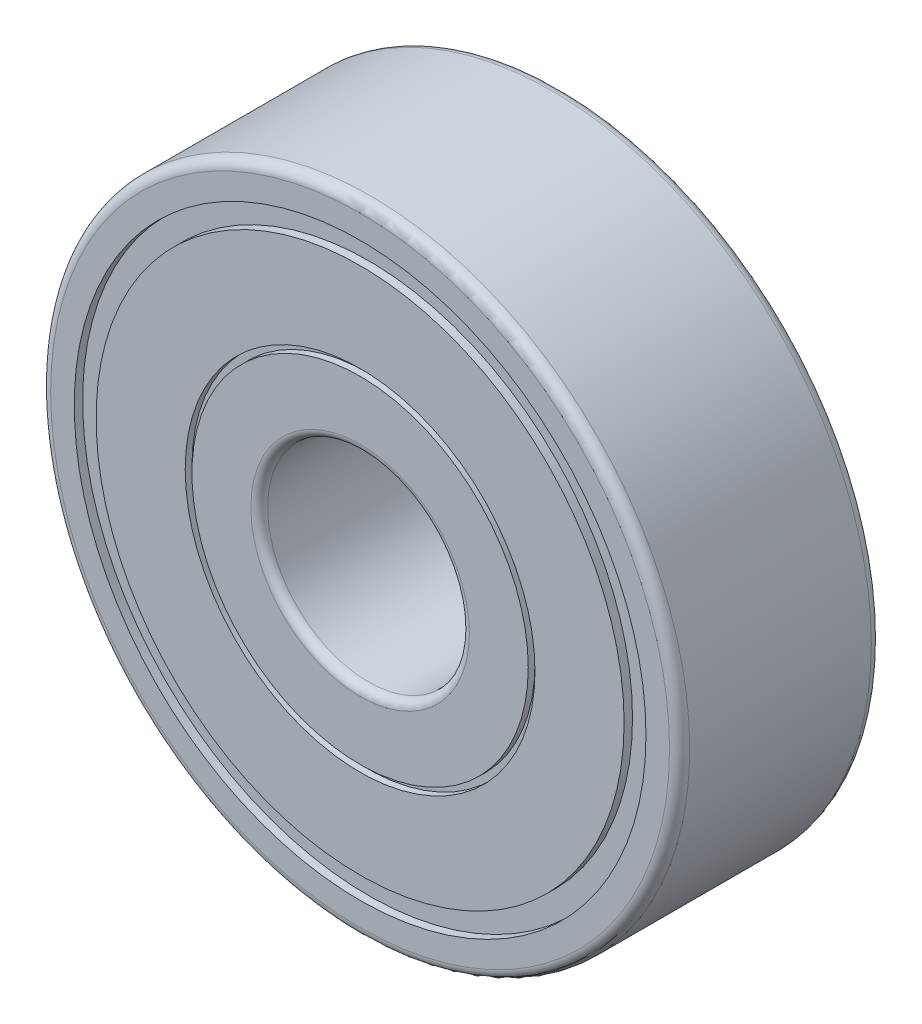
ISO-10303-21;
HEADER;
FILE_DESCRIPTION(('STEP AP214'),'2;1');
FILE_NAME('part.step','',(''),(''),'','','');
FILE_SCHEMA(('AUTOMOTIVE_DESIGN { 1 0 10303 214 1 1 1 1 }'));
ENDSEC;
DATA;
#1=APPLICATION_CONTEXT('core data for automotive mechanical design processes');
#2=APPLICATION_PROTOCOL_DEFINITION('international standard','automotive_design',2000,#1);
#3=PRODUCT_CONTEXT('',#1,'mechanical');
#4=PRODUCT('Part','Part','',(#3));
#5=PRODUCT_RELATED_PRODUCT_CATEGORY('part','',(#4));
#6=PRODUCT_DEFINITION_FORMATION('','',#4);
#7=PRODUCT_DEFINITION_CONTEXT('part definition',#1,'design');
#8=PRODUCT_DEFINITION('design','',#6,#7);
#9=PRODUCT_DEFINITION_SHAPE('','',#8);
#10=(LENGTH_UNIT() NAMED_UNIT(*) SI_UNIT(.MILLI.,.METRE.));
#11=(NAMED_UNIT(*) PLANE_ANGLE_UNIT() SI_UNIT($,.RADIAN.));
#12=(NAMED_UNIT(*) SI_UNIT($,.STERADIAN.) SOLID_ANGLE_UNIT());
#13=UNCERTAINTY_MEASURE_WITH_UNIT(LENGTH_MEASURE(1.E-05),#10,'distance_accuracy_value','');
#14=(GEOMETRIC_REPRESENTATION_CONTEXT(3) GLOBAL_UNCERTAINTY_ASSIGNED_CONTEXT((#13)) GLOBAL_UNIT_ASSIGNED_CONTEXT((#10,
#11,#12)) REPRESENTATION_CONTEXT('',''));
#15=CARTESIAN_POINT('',(0.,0.,0.));
#16=DIRECTION('',(0.,0.,1.));
#17=DIRECTION('',(1.,0.,0.));
#18=AXIS2_PLACEMENT_3D('',#15,#16,#17);
#19=CARTESIAN_POINT('',(0.,0.,0.));
#20=DIRECTION('',(0.,0.,1.));
#21=DIRECTION('',(1.,0.,0.));
#22=AXIS2_PLACEMENT_3D('',#19,#20,#21);
#23=PLANE('',#22);
#24=CARTESIAN_POINT('',(0.,0.,0.));
#25=DIRECTION('',(0.,0.,1.));
#26=DIRECTION('',(1.,0.,0.));
#27=AXIS2_PLACEMENT_3D('',#24,#25,#26);
#28=CIRCLE('',#27,5.2);
#29=CARTESIAN_POINT('',(5.2,0.,0.));
#30=VERTEX_POINT('',#29);
#31=EDGE_CURVE('E89',#30,#30,#28,.T.);
#32=ORIENTED_EDGE('',*,*,#31,.T.);
#33=EDGE_LOOP('',(#32));
#34=FACE_BOUND('',#33,.T.);
#35=CARTESIAN_POINT('',(0.,0.,0.));
#36=DIRECTION('',(0.,0.,1.));
#37=DIRECTION('',(1.,0.,0.));
#38=AXIS2_PLACEMENT_3D('',#35,#36,#37);
#39=CIRCLE('',#38,7.85);
#40=CARTESIAN_POINT('',(7.85,0.,0.));
#41=VERTEX_POINT('',#40);
#42=EDGE_CURVE('E107',#41,#41,#39,.T.);
#43=ORIENTED_EDGE('',*,*,#42,.F.);
#44=EDGE_LOOP('',(#43));
#45=FACE_BOUND('',#44,.T.);
#46=ADVANCED_FACE('F32',(#34,#45),#23,.F.);
#47=CARTESIAN_POINT('',(0.,0.,0.));
#48=DIRECTION('',(0.,0.,1.));
#49=DIRECTION('',(1.,0.,0.));
#50=AXIS2_PLACEMENT_3D('',#47,#48,#49);
#51=CIRCLE('',#50,3.25);
#52=CARTESIAN_POINT('',(3.25,0.,0.));
#53=VERTEX_POINT('',#52);
#54=EDGE_CURVE('E47',#53,#53,#51,.T.);
#55=ORIENTED_EDGE('',*,*,#54,.T.);
#56=EDGE_LOOP('',(#55));
#57=FACE_BOUND('',#56,.T.);
#58=CARTESIAN_POINT('',(0.,0.,0.));
#59=DIRECTION('',(0.,0.,1.));
#60=DIRECTION('',(1.,0.,0.));
#61=AXIS2_PLACEMENT_3D('',#58,#59,#60);
#62=CIRCLE('',#61,5.);
#63=CARTESIAN_POINT('',(5.,0.,0.));
#64=VERTEX_POINT('',#63);
#65=EDGE_CURVE('E95',#64,#64,#62,.T.);
#66=ORIENTED_EDGE('',*,*,#65,.F.);
#67=EDGE_LOOP('',(#66));
#68=FACE_BOUND('',#67,.T.);
#69=ADVANCED_FACE('F124',(#57,#68),#23,.F.);
#70=CARTESIAN_POINT('',(0.,0.,6.));
#71=DIRECTION('',(0.,0.,1.));
#72=DIRECTION('',(1.,0.,0.));
#73=AXIS2_PLACEMENT_3D('',#70,#71,#72);
#74=PLANE('',#73);
#75=CARTESIAN_POINT('',(0.,0.,6.));
#76=DIRECTION('',(0.,0.,1.));
#77=DIRECTION('',(1.,0.,0.));
#78=AXIS2_PLACEMENT_3D('',#75,#76,#77);
#79=CIRCLE('',#78,5.2);
#80=CARTESIAN_POINT('',(5.2,0.,6.));
#81=VERTEX_POINT('',#80);
#82=EDGE_CURVE('E65',#81,#81,#79,.T.);
#83=ORIENTED_EDGE('',*,*,#82,.F.);
#84=EDGE_LOOP('',(#83));
#85=FACE_BOUND('',#84,.T.);
#86=CARTESIAN_POINT('',(0.,0.,6.));
#87=DIRECTION('',(0.,0.,1.));
#88=DIRECTION('',(1.,0.,0.));
#89=AXIS2_PLACEMENT_3D('',#86,#87,#88);
#90=CIRCLE('',#89,7.85);
#91=CARTESIAN_POINT('',(7.85,0.,6.));
#92=VERTEX_POINT('',#91);
#93=EDGE_CURVE('E83',#92,#92,#90,.T.);
#94=ORIENTED_EDGE('',*,*,#93,.T.);
#95=EDGE_LOOP('',(#94));
#96=FACE_BOUND('',#95,.T.);
#97=ADVANCED_FACE('F131',(#85,#96),#74,.T.);
#98=CARTESIAN_POINT('',(0.,0.,6.));
#99=DIRECTION('',(0.,0.,1.));
#100=DIRECTION('',(1.,0.,0.));
#101=AXIS2_PLACEMENT_3D('',#98,#99,#100);
#102=CIRCLE('',#101,3.25);
#103=CARTESIAN_POINT('',(3.25,0.,6.));
#104=VERTEX_POINT('',#103);
#105=EDGE_CURVE('E10',#104,#104,#102,.F.);
#106=ORIENTED_EDGE('',*,*,#105,.T.);
#107=EDGE_LOOP('',(#106));
#108=FACE_BOUND('',#107,.T.);
#109=CARTESIAN_POINT('',(0.,0.,6.));
#110=DIRECTION('',(0.,0.,1.));
#111=DIRECTION('',(1.,0.,0.));
#112=AXIS2_PLACEMENT_3D('',#109,#110,#111);
#113=CIRCLE('',#112,5.);
#114=CARTESIAN_POINT('',(5.,0.,6.));
#115=VERTEX_POINT('',#114);
#116=EDGE_CURVE('E71',#115,#115,#113,.T.);
#117=ORIENTED_EDGE('',*,*,#116,.T.);
#118=EDGE_LOOP('',(#117));
#119=FACE_BOUND('',#118,.T.);
#120=ADVANCED_FACE('F145',(#108,#119),#74,.T.);
#121=CARTESIAN_POINT('',(0.,0.,6.));
#122=DIRECTION('',(0.,0.,1.));
#123=DIRECTION('',(1.,0.,0.));
#124=AXIS2_PLACEMENT_3D('',#121,#122,#123);
#125=CIRCLE('',#124,9.2);
#126=CARTESIAN_POINT('',(9.2,0.,6.));
#127=VERTEX_POINT('',#126);
#128=EDGE_CURVE('E52',#127,#127,#125,.T.);
#129=ORIENTED_EDGE('',*,*,#128,.T.);
#130=EDGE_LOOP('',(#129));
#131=FACE_BOUND('',#130,.T.);
#132=CARTESIAN_POINT('',(0.,0.,6.));
#133=DIRECTION('',(0.,0.,1.));
#134=DIRECTION('',(1.,0.,0.));
#135=AXIS2_PLACEMENT_3D('',#132,#133,#134);
#136=CIRCLE('',#135,8.5);
#137=CARTESIAN_POINT('',(8.5,0.,6.));
#138=VERTEX_POINT('',#137);
#139=EDGE_CURVE('E77',#138,#138,#136,.T.);
#140=ORIENTED_EDGE('',*,*,#139,.F.);
#141=EDGE_LOOP('',(#140));
#142=FACE_BOUND('',#141,.T.);
#143=ADVANCED_FACE('F137',(#131,#142),#74,.T.);
#144=CARTESIAN_POINT('',(0.,0.,0.));
#145=DIRECTION('',(0.,0.,1.));
#146=DIRECTION('',(1.,0.,0.));
#147=AXIS2_PLACEMENT_3D('',#144,#145,#146);
#148=CIRCLE('',#147,9.2);
#149=CARTESIAN_POINT('',(9.2,0.,0.));
#150=VERTEX_POINT('',#149);
#151=EDGE_CURVE('E55',#150,#150,#148,.F.);
#152=ORIENTED_EDGE('',*,*,#151,.T.);
#153=EDGE_LOOP('',(#152));
#154=FACE_BOUND('',#153,.T.);
#155=CARTESIAN_POINT('',(0.,0.,0.));
#156=DIRECTION('',(0.,0.,1.));
#157=DIRECTION('',(1.,0.,0.));
#158=AXIS2_PLACEMENT_3D('',#155,#156,#157);
#159=CIRCLE('',#158,8.5);
#160=CARTESIAN_POINT('',(8.5,0.,0.));
#161=VERTEX_POINT('',#160);
#162=EDGE_CURVE('E101',#161,#161,#159,.T.);
#163=ORIENTED_EDGE('',*,*,#162,.T.);
#164=EDGE_LOOP('',(#163));
#165=FACE_BOUND('',#164,.T.);
#166=ADVANCED_FACE('F127',(#154,#165),#23,.F.);
#167=CARTESIAN_POINT('',(0.,0.,6.));
#168=DIRECTION('',(0.,0.,-1.));
#169=DIRECTION('',(-1.,0.,0.));
#170=AXIS2_PLACEMENT_3D('',#167,#168,#169);
#171=CYLINDRICAL_SURFACE('',#170,9.5);
#172=CARTESIAN_POINT('',(0.,0.,0.3));
#173=DIRECTION('',(0.,0.,1.));
#174=DIRECTION('',(1.,0.,0.));
#175=AXIS2_PLACEMENT_3D('',#172,#173,#174);
#176=CIRCLE('',#175,9.5);
#177=CARTESIAN_POINT('',(9.5,0.,0.3));
#178=VERTEX_POINT('',#177);
#179=EDGE_CURVE('E58',#178,#178,#176,.T.);
#180=ORIENTED_EDGE('',*,*,#179,.T.);
#181=EDGE_LOOP('',(#180));
#182=FACE_BOUND('',#181,.T.);
#183=CARTESIAN_POINT('',(0.,0.,5.7));
#184=DIRECTION('',(0.,0.,1.));
#185=DIRECTION('',(1.,0.,0.));
#186=AXIS2_PLACEMENT_3D('',#183,#184,#185);
#187=CIRCLE('',#186,9.5);
#188=CARTESIAN_POINT('',(9.5,0.,5.7));
#189=VERTEX_POINT('',#188);
#190=EDGE_CURVE('E61',#189,#189,#187,.F.);
#191=ORIENTED_EDGE('',*,*,#190,.T.);
#192=EDGE_LOOP('',(#191));
#193=FACE_BOUND('',#192,.T.);
#194=ADVANCED_FACE('F136',(#182,#193),#171,.T.);
#195=CARTESIAN_POINT('',(0.,0.,6.));
#196=DIRECTION('',(0.,0.,-1.));
#197=DIRECTION('',(-1.,0.,0.));
#198=AXIS2_PLACEMENT_3D('',#195,#196,#197);
#199=CYLINDRICAL_SURFACE('',#198,3.);
#200=CARTESIAN_POINT('',(0.,0.,0.25));
#201=DIRECTION('',(0.,0.,1.));
#202=DIRECTION('',(1.,0.,0.));
#203=AXIS2_PLACEMENT_3D('',#200,#201,#202);
#204=CIRCLE('',#203,3.);
#205=CARTESIAN_POINT('',(3.,0.,0.25));
#206=VERTEX_POINT('',#205);
#207=EDGE_CURVE('E39',#206,#206,#204,.F.);
#208=ORIENTED_EDGE('',*,*,#207,.T.);
#209=EDGE_LOOP('',(#208));
#210=FACE_BOUND('',#209,.T.);
#211=CARTESIAN_POINT('',(0.,0.,5.75));
#212=DIRECTION('',(0.,0.,1.));
#213=DIRECTION('',(1.,0.,0.));
#214=AXIS2_PLACEMENT_3D('',#211,#212,#213);
#215=CIRCLE('',#214,3.);
#216=CARTESIAN_POINT('',(3.,0.,5.75));
#217=VERTEX_POINT('',#216);
#218=EDGE_CURVE('E43',#217,#217,#215,.T.);
#219=ORIENTED_EDGE('',*,*,#218,.T.);
#220=EDGE_LOOP('',(#219));
#221=FACE_BOUND('',#220,.T.);
#222=ADVANCED_FACE('F143',(#210,#221),#199,.F.);
#223=CARTESIAN_POINT('',(0.,0.,5.8));
#224=DIRECTION('',(0.,0.,1.));
#225=DIRECTION('',(1.,0.,0.));
#226=AXIS2_PLACEMENT_3D('',#223,#224,#225);
#227=CYLINDRICAL_SURFACE('',#226,5.2);
#228=CARTESIAN_POINT('',(0.,0.,5.8));
#229=DIRECTION('',(0.,0.,1.));
#230=DIRECTION('',(1.,0.,0.));
#231=AXIS2_PLACEMENT_3D('',#228,#229,#230);
#232=CIRCLE('',#231,5.2);
#233=CARTESIAN_POINT('',(5.2,0.,5.8));
#234=VERTEX_POINT('',#233);
#235=EDGE_CURVE('E64',#234,#234,#232,.T.);
#236=ORIENTED_EDGE('',*,*,#235,.F.);
#237=EDGE_LOOP('',(#236));
#238=FACE_BOUND('',#237,.T.);
#239=ORIENTED_EDGE('',*,*,#82,.T.);
#240=EDGE_LOOP('',(#239));
#241=FACE_BOUND('',#240,.T.);
#242=ADVANCED_FACE('F191',(#238,#241),#227,.F.);
#243=CARTESIAN_POINT('',(0.,0.,5.8));
#244=DIRECTION('',(0.,0.,1.));
#245=DIRECTION('',(1.,0.,0.));
#246=AXIS2_PLACEMENT_3D('',#243,#244,#245);
#247=PLANE('',#246);
#248=CARTESIAN_POINT('',(0.,0.,5.8));
#249=DIRECTION('',(0.,0.,1.));
#250=DIRECTION('',(1.,0.,0.));
#251=AXIS2_PLACEMENT_3D('',#248,#249,#250);
#252=CIRCLE('',#251,5.);
#253=CARTESIAN_POINT('',(5.,0.,5.8));
#254=VERTEX_POINT('',#253);
#255=EDGE_CURVE('E68',#254,#254,#252,.T.);
#256=ORIENTED_EDGE('',*,*,#255,.F.);
#257=EDGE_LOOP('',(#256));
#258=FACE_BOUND('',#257,.T.);
#259=ORIENTED_EDGE('',*,*,#235,.T.);
#260=EDGE_LOOP('',(#259));
#261=FACE_BOUND('',#260,.T.);
#262=ADVANCED_FACE('F187',(#258,#261),#247,.T.);
#263=CARTESIAN_POINT('',(0.,0.,5.8));
#264=DIRECTION('',(0.,0.,1.));
#265=DIRECTION('',(1.,0.,0.));
#266=AXIS2_PLACEMENT_3D('',#263,#264,#265);
#267=CYLINDRICAL_SURFACE('',#266,5.);
#268=ORIENTED_EDGE('',*,*,#255,.T.);
#269=EDGE_LOOP('',(#268));
#270=FACE_BOUND('',#269,.T.);
#271=ORIENTED_EDGE('',*,*,#116,.F.);
#272=EDGE_LOOP('',(#271));
#273=FACE_BOUND('',#272,.T.);
#274=ADVANCED_FACE('F183',(#270,#273),#267,.T.);
#275=CARTESIAN_POINT('',(0.,0.,5.75));
#276=DIRECTION('',(0.,0.,1.));
#277=DIRECTION('',(1.,0.,0.));
#278=AXIS2_PLACEMENT_3D('',#275,#276,#277);
#279=CYLINDRICAL_SURFACE('',#278,8.5);
#280=CARTESIAN_POINT('',(0.,0.,5.75));
#281=DIRECTION('',(0.,0.,1.));
#282=DIRECTION('',(1.,0.,0.));
#283=AXIS2_PLACEMENT_3D('',#280,#281,#282);
#284=CIRCLE('',#283,8.5);
#285=CARTESIAN_POINT('',(8.5,0.,5.75));
#286=VERTEX_POINT('',#285);
#287=EDGE_CURVE('E74',#286,#286,#284,.T.);
#288=ORIENTED_EDGE('',*,*,#287,.F.);
#289=EDGE_LOOP('',(#288));
#290=FACE_BOUND('',#289,.T.);
#291=ORIENTED_EDGE('',*,*,#139,.T.);
#292=EDGE_LOOP('',(#291));
#293=FACE_BOUND('',#292,.T.);
#294=ADVANCED_FACE('F179',(#290,#293),#279,.F.);
#295=CARTESIAN_POINT('',(0.,0.,5.75));
#296=DIRECTION('',(0.,0.,1.));
#297=DIRECTION('',(1.,0.,0.));
#298=AXIS2_PLACEMENT_3D('',#295,#296,#297);
#299=PLANE('',#298);
#300=CARTESIAN_POINT('',(0.,0.,5.75));
#301=DIRECTION('',(0.,0.,1.));
#302=DIRECTION('',(1.,0.,0.));
#303=AXIS2_PLACEMENT_3D('',#300,#301,#302);
#304=CIRCLE('',#303,7.85);
#305=CARTESIAN_POINT('',(7.85,0.,5.75));
#306=VERTEX_POINT('',#305);
#307=EDGE_CURVE('E80',#306,#306,#304,.T.);
#308=ORIENTED_EDGE('',*,*,#307,.F.);
#309=EDGE_LOOP('',(#308));
#310=FACE_BOUND('',#309,.T.);
#311=ORIENTED_EDGE('',*,*,#287,.T.);
#312=EDGE_LOOP('',(#311));
#313=FACE_BOUND('',#312,.T.);
#314=ADVANCED_FACE('F175',(#310,#313),#299,.T.);
#315=CARTESIAN_POINT('',(0.,0.,5.75));
#316=DIRECTION('',(0.,0.,1.));
#317=DIRECTION('',(1.,0.,0.));
#318=AXIS2_PLACEMENT_3D('',#315,#316,#317);
#319=CYLINDRICAL_SURFACE('',#318,7.85);
#320=ORIENTED_EDGE('',*,*,#307,.T.);
#321=EDGE_LOOP('',(#320));
#322=FACE_BOUND('',#321,.T.);
#323=ORIENTED_EDGE('',*,*,#93,.F.);
#324=EDGE_LOOP('',(#323));
#325=FACE_BOUND('',#324,.T.);
#326=ADVANCED_FACE('F168',(#322,#325),#319,.T.);
#327=CARTESIAN_POINT('',(0.,0.,0.2));
#328=DIRECTION('',(0.,0.,-1.));
#329=DIRECTION('',(1.,0.,0.));
#330=AXIS2_PLACEMENT_3D('',#327,#328,#329);
#331=PLANE('',#330);
#332=CARTESIAN_POINT('',(0.,0.,0.2));
#333=DIRECTION('',(0.,0.,1.));
#334=DIRECTION('',(1.,0.,0.));
#335=AXIS2_PLACEMENT_3D('',#332,#333,#334);
#336=CIRCLE('',#335,5.2);
#337=CARTESIAN_POINT('',(5.2,0.,0.2));
#338=VERTEX_POINT('',#337);
#339=EDGE_CURVE('E86',#338,#338,#336,.T.);
#340=ORIENTED_EDGE('',*,*,#339,.F.);
#341=EDGE_LOOP('',(#340));
#342=FACE_BOUND('',#341,.T.);
#343=CARTESIAN_POINT('',(0.,0.,0.2));
#344=DIRECTION('',(0.,0.,1.));
#345=DIRECTION('',(1.,0.,0.));
#346=AXIS2_PLACEMENT_3D('',#343,#344,#345);
#347=CIRCLE('',#346,5.);
#348=CARTESIAN_POINT('',(5.,0.,0.2));
#349=VERTEX_POINT('',#348);
#350=EDGE_CURVE('E92',#349,#349,#347,.T.);
#351=ORIENTED_EDGE('',*,*,#350,.T.);
#352=EDGE_LOOP('',(#351));
#353=FACE_BOUND('',#352,.T.);
#354=ADVANCED_FACE('F165',(#342,#353),#331,.T.);
#355=CARTESIAN_POINT('',(0.,0.,0.2));
#356=DIRECTION('',(0.,0.,-1.));
#357=DIRECTION('',(-1.,0.,0.));
#358=AXIS2_PLACEMENT_3D('',#355,#356,#357);
#359=CYLINDRICAL_SURFACE('',#358,5.2);
#360=ORIENTED_EDGE('',*,*,#339,.T.);
#361=EDGE_LOOP('',(#360));
#362=FACE_BOUND('',#361,.T.);
#363=ORIENTED_EDGE('',*,*,#31,.F.);
#364=EDGE_LOOP('',(#363));
#365=FACE_BOUND('',#364,.T.);
#366=ADVANCED_FACE('F163',(#362,#365),#359,.F.);
#367=CARTESIAN_POINT('',(0.,0.,0.2));
#368=DIRECTION('',(0.,0.,-1.));
#369=DIRECTION('',(-1.,0.,0.));
#370=AXIS2_PLACEMENT_3D('',#367,#368,#369);
#371=CYLINDRICAL_SURFACE('',#370,5.);
#372=ORIENTED_EDGE('',*,*,#350,.F.);
#373=EDGE_LOOP('',(#372));
#374=FACE_BOUND('',#373,.T.);
#375=ORIENTED_EDGE('',*,*,#65,.T.);
#376=EDGE_LOOP('',(#375));
#377=FACE_BOUND('',#376,.T.);
#378=ADVANCED_FACE('F157',(#374,#377),#371,.T.);
#379=CARTESIAN_POINT('',(0.,0.,0.25));
#380=DIRECTION('',(0.,0.,-1.));
#381=DIRECTION('',(1.,0.,0.));
#382=AXIS2_PLACEMENT_3D('',#379,#380,#381);
#383=PLANE('',#382);
#384=CARTESIAN_POINT('',(0.,0.,0.25));
#385=DIRECTION('',(0.,0.,1.));
#386=DIRECTION('',(1.,0.,0.));
#387=AXIS2_PLACEMENT_3D('',#384,#385,#386);
#388=CIRCLE('',#387,8.5);
#389=CARTESIAN_POINT('',(8.5,0.,0.25));
#390=VERTEX_POINT('',#389);
#391=EDGE_CURVE('E98',#390,#390,#388,.T.);
#392=ORIENTED_EDGE('',*,*,#391,.F.);
#393=EDGE_LOOP('',(#392));
#394=FACE_BOUND('',#393,.T.);
#395=CARTESIAN_POINT('',(0.,0.,0.25));
#396=DIRECTION('',(0.,0.,1.));
#397=DIRECTION('',(1.,0.,0.));
#398=AXIS2_PLACEMENT_3D('',#395,#396,#397);
#399=CIRCLE('',#398,7.85);
#400=CARTESIAN_POINT('',(7.85,0.,0.25));
#401=VERTEX_POINT('',#400);
#402=EDGE_CURVE('E104',#401,#401,#399,.T.);
#403=ORIENTED_EDGE('',*,*,#402,.T.);
#404=EDGE_LOOP('',(#403));
#405=FACE_BOUND('',#404,.T.);
#406=ADVANCED_FACE('F113',(#394,#405),#383,.T.);
#407=CARTESIAN_POINT('',(0.,0.,0.25));
#408=DIRECTION('',(0.,0.,-1.));
#409=DIRECTION('',(-1.,0.,0.));
#410=AXIS2_PLACEMENT_3D('',#407,#408,#409);
#411=CYLINDRICAL_SURFACE('',#410,8.5);
#412=ORIENTED_EDGE('',*,*,#391,.T.);
#413=EDGE_LOOP('',(#412));
#414=FACE_BOUND('',#413,.T.);
#415=ORIENTED_EDGE('',*,*,#162,.F.);
#416=EDGE_LOOP('',(#415));
#417=FACE_BOUND('',#416,.T.);
#418=ADVANCED_FACE('F119',(#414,#417),#411,.F.);
#419=CARTESIAN_POINT('',(0.,0.,0.25));
#420=DIRECTION('',(0.,0.,-1.));
#421=DIRECTION('',(-1.,0.,0.));
#422=AXIS2_PLACEMENT_3D('',#419,#420,#421);
#423=CYLINDRICAL_SURFACE('',#422,7.85);
#424=ORIENTED_EDGE('',*,*,#402,.F.);
#425=EDGE_LOOP('',(#424));
#426=FACE_BOUND('',#425,.T.);
#427=ORIENTED_EDGE('',*,*,#42,.T.);
#428=EDGE_LOOP('',(#427));
#429=FACE_BOUND('',#428,.T.);
#430=ADVANCED_FACE('F115',(#426,#429),#423,.T.);
#431=CARTESIAN_POINT('',(0.,0.,0.3));
#432=DIRECTION('',(0.,0.,1.));
#433=DIRECTION('',(1.,0.,0.));
#434=AXIS2_PLACEMENT_3D('',#431,#432,#433);
#435=TOROIDAL_SURFACE('',#434,9.2,0.3);
#436=ORIENTED_EDGE('',*,*,#151,.F.);
#437=EDGE_LOOP('',(#436));
#438=FACE_BOUND('',#437,.T.);
#439=ORIENTED_EDGE('',*,*,#179,.F.);
#440=EDGE_LOOP('',(#439));
#441=FACE_BOUND('',#440,.T.);
#442=ADVANCED_FACE('F118',(#438,#441),#435,.T.);
#443=CARTESIAN_POINT('',(0.,0.,5.7));
#444=DIRECTION('',(0.,0.,1.));
#445=DIRECTION('',(1.,0.,0.));
#446=AXIS2_PLACEMENT_3D('',#443,#444,#445);
#447=TOROIDAL_SURFACE('',#446,9.2,0.3);
#448=ORIENTED_EDGE('',*,*,#190,.F.);
#449=EDGE_LOOP('',(#448));
#450=FACE_BOUND('',#449,.T.);
#451=ORIENTED_EDGE('',*,*,#128,.F.);
#452=EDGE_LOOP('',(#451));
#453=FACE_BOUND('',#452,.T.);
#454=ADVANCED_FACE('F208',(#450,#453),#447,.T.);
#455=CARTESIAN_POINT('',(0.,0.,0.25));
#456=DIRECTION('',(0.,0.,1.));
#457=DIRECTION('',(1.,0.,0.));
#458=AXIS2_PLACEMENT_3D('',#455,#456,#457);
#459=TOROIDAL_SURFACE('',#458,3.25,0.25);
#460=ORIENTED_EDGE('',*,*,#207,.F.);
#461=EDGE_LOOP('',(#460));
#462=FACE_BOUND('',#461,.T.);
#463=ORIENTED_EDGE('',*,*,#54,.F.);
#464=EDGE_LOOP('',(#463));
#465=FACE_BOUND('',#464,.T.);
#466=ADVANCED_FACE('F203',(#462,#465),#459,.T.);
#467=CARTESIAN_POINT('',(0.,0.,5.75));
#468=DIRECTION('',(0.,0.,1.));
#469=DIRECTION('',(1.,0.,0.));
#470=AXIS2_PLACEMENT_3D('',#467,#468,#469);
#471=TOROIDAL_SURFACE('',#470,3.25,0.25);
#472=ORIENTED_EDGE('',*,*,#105,.F.);
#473=EDGE_LOOP('',(#472));
#474=FACE_BOUND('',#473,.T.);
#475=ORIENTED_EDGE('',*,*,#218,.F.);
#476=EDGE_LOOP('',(#475));
#477=FACE_BOUND('',#476,.T.);
#478=ADVANCED_FACE('F34',(#474,#477),#471,.T.);
#479=CLOSED_SHELL('',(#46,#69,#97,#120,#143,#166,#194,#222,#242,#262,#274,#294,#314,#326,#354,
#366,#378,#406,#418,#430,#442,#454,#466,#478));
#480=MANIFOLD_SOLID_BREP('B2',#479);
#481=ADVANCED_BREP_SHAPE_REPRESENTATION('',(#18,#480),#14);
#482=SHAPE_DEFINITION_REPRESENTATION(#9,#481);
ENDSEC;
END-ISO-10303-21;
